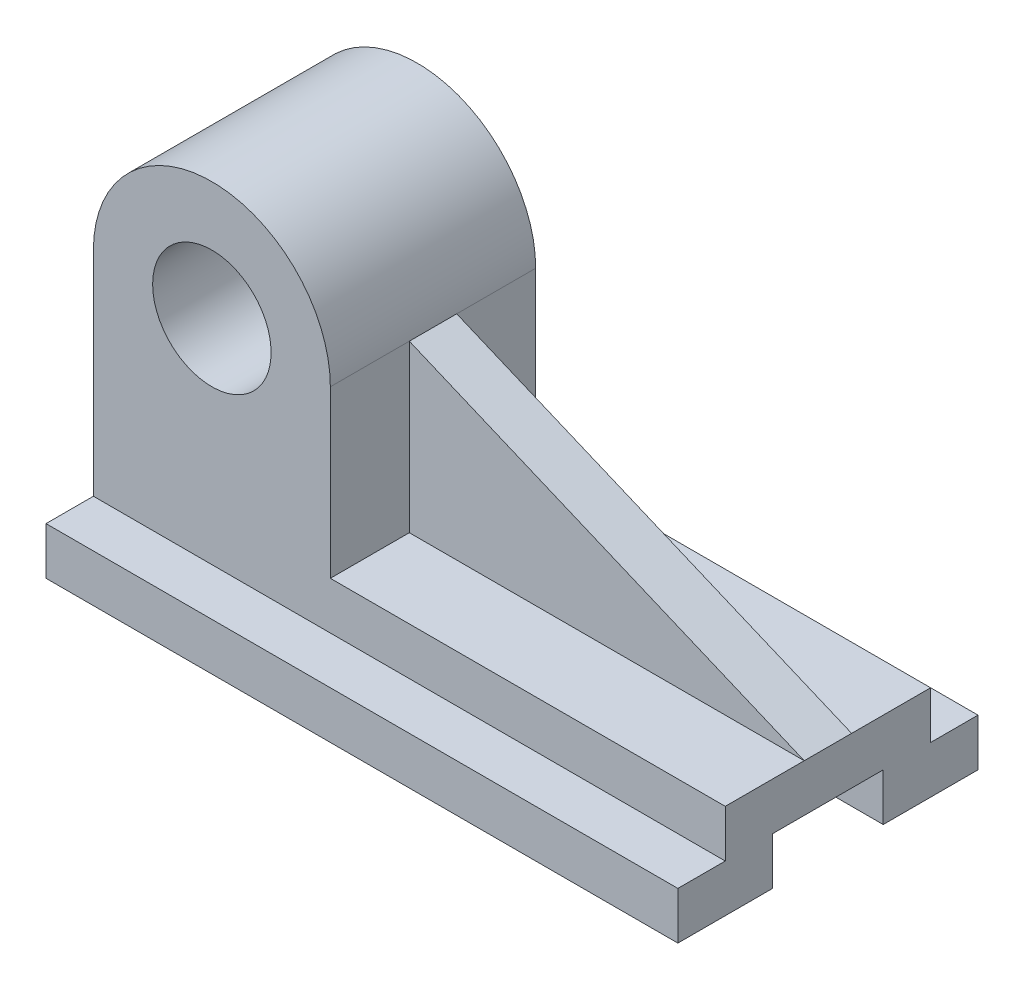
ISO-10303-21;
HEADER;
FILE_DESCRIPTION(('STEP AP214'),'2;1');
FILE_NAME('part.step','',(''),(''),'','','');
FILE_SCHEMA(('AUTOMOTIVE_DESIGN { 1 0 10303 214 1 1 1 1 }'));
ENDSEC;
DATA;
#1=APPLICATION_CONTEXT('core data for automotive mechanical design processes');
#2=APPLICATION_PROTOCOL_DEFINITION('international standard','automotive_design',2000,#1);
#3=PRODUCT_CONTEXT('',#1,'mechanical');
#4=PRODUCT('Part','Part','',(#3));
#5=PRODUCT_RELATED_PRODUCT_CATEGORY('part','',(#4));
#6=PRODUCT_DEFINITION_FORMATION('','',#4);
#7=PRODUCT_DEFINITION_CONTEXT('part definition',#1,'design');
#8=PRODUCT_DEFINITION('design','',#6,#7);
#9=PRODUCT_DEFINITION_SHAPE('','',#8);
#10=(LENGTH_UNIT() NAMED_UNIT(*) SI_UNIT(.MILLI.,.METRE.));
#11=(NAMED_UNIT(*) PLANE_ANGLE_UNIT() SI_UNIT($,.RADIAN.));
#12=(NAMED_UNIT(*) SI_UNIT($,.STERADIAN.) SOLID_ANGLE_UNIT());
#13=UNCERTAINTY_MEASURE_WITH_UNIT(LENGTH_MEASURE(1.E-05),#10,'distance_accuracy_value','');
#14=(GEOMETRIC_REPRESENTATION_CONTEXT(3) GLOBAL_UNCERTAINTY_ASSIGNED_CONTEXT((#13)) GLOBAL_UNIT_ASSIGNED_CONTEXT((#10,
#11,#12)) REPRESENTATION_CONTEXT('',''));
#15=CARTESIAN_POINT('',(0.,0.,0.));
#16=DIRECTION('',(0.,0.,1.));
#17=DIRECTION('',(1.,0.,0.));
#18=AXIS2_PLACEMENT_3D('',#15,#16,#17);
#19=CARTESIAN_POINT('',(-80.,6.,-26.));
#20=DIRECTION('',(0.,1.,0.));
#21=DIRECTION('',(0.,0.,1.));
#22=AXIS2_PLACEMENT_3D('',#19,#20,#21);
#23=PLANE('',#22);
#24=DIRECTION('',(0.,0.,-1.));
#25=VECTOR('',#24,1.);
#26=CARTESIAN_POINT('',(-20.,6.,26.));
#27=LINE('',#26,#25);
#28=CARTESIAN_POINT('',(-20.,6.,-6.));
#29=VERTEX_POINT('',#28);
#30=CARTESIAN_POINT('',(-20.,6.,-26.));
#31=VERTEX_POINT('',#30);
#32=EDGE_CURVE('E193',#29,#31,#27,.T.);
#33=ORIENTED_EDGE('',*,*,#32,.F.);
#34=DIRECTION('',(1.,0.,0.));
#35=VECTOR('',#34,1.);
#36=CARTESIAN_POINT('',(-80.,6.,-6.));
#37=LINE('',#36,#35);
#38=CARTESIAN_POINT('',(80.,6.,-6.));
#39=VERTEX_POINT('',#38);
#40=EDGE_CURVE('E183',#29,#39,#37,.T.);
#41=ORIENTED_EDGE('',*,*,#40,.T.);
#42=DIRECTION('',(0.,0.,1.));
#43=VECTOR('',#42,1.);
#44=CARTESIAN_POINT('',(80.,6.,-26.));
#45=LINE('',#44,#43);
#46=CARTESIAN_POINT('',(80.,6.,-26.));
#47=VERTEX_POINT('',#46);
#48=EDGE_CURVE('E51',#47,#39,#45,.T.);
#49=ORIENTED_EDGE('',*,*,#48,.F.);
#50=DIRECTION('',(-1.,0.,0.));
#51=VECTOR('',#50,1.);
#52=CARTESIAN_POINT('',(-80.,6.,-26.));
#53=LINE('',#52,#51);
#54=EDGE_CURVE('E215',#47,#31,#53,.T.);
#55=ORIENTED_EDGE('',*,*,#54,.T.);
#56=EDGE_LOOP('',(#33,#41,#49,#55));
#57=FACE_BOUND('',#56,.T.);
#58=ADVANCED_FACE('F47',(#57),#23,.T.);
#59=CARTESIAN_POINT('',(-20.,0.,26.));
#60=DIRECTION('',(-1.,0.,0.));
#61=DIRECTION('',(0.,0.,1.));
#62=AXIS2_PLACEMENT_3D('',#59,#60,#61);
#63=PLANE('',#62);
#64=DIRECTION('',(0.,1.,0.));
#65=VECTOR('',#64,1.);
#66=CARTESIAN_POINT('',(-20.,0.,-6.));
#67=LINE('',#66,#65);
#68=CARTESIAN_POINT('',(-20.,48.,-5.99999999999999));
#69=VERTEX_POINT('',#68);
#70=EDGE_CURVE('E185',#29,#69,#67,.T.);
#71=ORIENTED_EDGE('',*,*,#70,.F.);
#72=ORIENTED_EDGE('',*,*,#32,.T.);
#73=DIRECTION('',(0.,1.,0.));
#74=VECTOR('',#73,1.);
#75=CARTESIAN_POINT('',(-20.,0.,-26.));
#76=LINE('',#75,#74);
#77=CARTESIAN_POINT('',(-20.,48.,-26.));
#78=VERTEX_POINT('',#77);
#79=EDGE_CURVE('E333',#31,#78,#76,.T.);
#80=ORIENTED_EDGE('',*,*,#79,.T.);
#81=DIRECTION('',(0.,0.,-1.));
#82=VECTOR('',#81,1.);
#83=CARTESIAN_POINT('',(-20.,48.,26.));
#84=LINE('',#83,#82);
#85=EDGE_CURVE('E324',#69,#78,#84,.T.);
#86=ORIENTED_EDGE('',*,*,#85,.F.);
#87=EDGE_LOOP('',(#71,#72,#80,#86));
#88=FACE_BOUND('',#87,.T.);
#89=ADVANCED_FACE('F368',(#88),#63,.F.);
#90=CARTESIAN_POINT('',(-80.,-6.,-26.));
#91=DIRECTION('',(0.,-1.,0.));
#92=DIRECTION('',(0.,0.,-1.));
#93=AXIS2_PLACEMENT_3D('',#90,#91,#92);
#94=PLANE('',#93);
#95=DIRECTION('',(-1.,0.,0.));
#96=VECTOR('',#95,1.);
#97=CARTESIAN_POINT('',(-80.,-6.,14.));
#98=LINE('',#97,#96);
#99=CARTESIAN_POINT('',(80.,-6.,14.));
#100=VERTEX_POINT('',#99);
#101=CARTESIAN_POINT('',(-80.,-6.,14.));
#102=VERTEX_POINT('',#101);
#103=EDGE_CURVE('E254',#100,#102,#98,.T.);
#104=ORIENTED_EDGE('',*,*,#103,.T.);
#105=DIRECTION('',(0.,0.,1.));
#106=VECTOR('',#105,1.);
#107=CARTESIAN_POINT('',(-80.,-6.,-26.));
#108=LINE('',#107,#106);
#109=CARTESIAN_POINT('',(-80.,-6.,-14.));
#110=VERTEX_POINT('',#109);
#111=EDGE_CURVE('E57',#110,#102,#108,.T.);
#112=ORIENTED_EDGE('',*,*,#111,.F.);
#113=DIRECTION('',(1.,0.,0.));
#114=VECTOR('',#113,1.);
#115=CARTESIAN_POINT('',(80.,-6.,-14.));
#116=LINE('',#115,#114);
#117=CARTESIAN_POINT('',(80.,-6.,-14.));
#118=VERTEX_POINT('',#117);
#119=EDGE_CURVE('E295',#110,#118,#116,.T.);
#120=ORIENTED_EDGE('',*,*,#119,.T.);
#121=DIRECTION('',(0.,0.,1.));
#122=VECTOR('',#121,1.);
#123=CARTESIAN_POINT('',(80.,-6.,-26.));
#124=LINE('',#123,#122);
#125=EDGE_CURVE('E11',#118,#100,#124,.T.);
#126=ORIENTED_EDGE('',*,*,#125,.T.);
#127=EDGE_LOOP('',(#104,#112,#120,#126));
#128=FACE_BOUND('',#127,.T.);
#129=ADVANCED_FACE('F403',(#128),#94,.T.);
#130=CARTESIAN_POINT('',(80.,6.,-26.));
#131=DIRECTION('',(1.,0.,0.));
#132=DIRECTION('',(0.,0.,-1.));
#133=AXIS2_PLACEMENT_3D('',#130,#131,#132);
#134=PLANE('',#133);
#135=DIRECTION('',(0.,1.,0.));
#136=VECTOR('',#135,1.);
#137=CARTESIAN_POINT('',(80.,-6.,14.));
#138=LINE('',#137,#136);
#139=CARTESIAN_POINT('',(80.,-18.,14.));
#140=VERTEX_POINT('',#139);
#141=EDGE_CURVE('E259',#140,#100,#138,.T.);
#142=ORIENTED_EDGE('',*,*,#141,.T.);
#143=ORIENTED_EDGE('',*,*,#125,.F.);
#144=DIRECTION('',(0.,-1.,0.));
#145=VECTOR('',#144,1.);
#146=CARTESIAN_POINT('',(80.,-6.,-14.));
#147=LINE('',#146,#145);
#148=CARTESIAN_POINT('',(80.,-18.,-14.));
#149=VERTEX_POINT('',#148);
#150=EDGE_CURVE('E306',#118,#149,#147,.T.);
#151=ORIENTED_EDGE('',*,*,#150,.T.);
#152=DIRECTION('',(0.,0.,1.));
#153=VECTOR('',#152,1.);
#154=CARTESIAN_POINT('',(80.,-18.,-38.));
#155=LINE('',#154,#153);
#156=CARTESIAN_POINT('',(80.,-18.,-38.));
#157=VERTEX_POINT('',#156);
#158=EDGE_CURVE('E269',#157,#149,#155,.T.);
#159=ORIENTED_EDGE('',*,*,#158,.F.);
#160=DIRECTION('',(0.,-1.,0.));
#161=VECTOR('',#160,1.);
#162=CARTESIAN_POINT('',(80.,-6.,-38.));
#163=LINE('',#162,#161);
#164=CARTESIAN_POINT('',(80.,-6.,-38.));
#165=VERTEX_POINT('',#164);
#166=EDGE_CURVE('E298',#165,#157,#163,.T.);
#167=ORIENTED_EDGE('',*,*,#166,.F.);
#168=DIRECTION('',(0.,0.,1.));
#169=VECTOR('',#168,1.);
#170=CARTESIAN_POINT('',(80.,-6.,-38.));
#171=LINE('',#170,#169);
#172=CARTESIAN_POINT('',(80.,-6.,-26.));
#173=VERTEX_POINT('',#172);
#174=EDGE_CURVE('E291',#165,#173,#171,.T.);
#175=ORIENTED_EDGE('',*,*,#174,.T.);
#176=DIRECTION('',(0.,1.,0.));
#177=VECTOR('',#176,1.);
#178=CARTESIAN_POINT('',(80.,6.,-26.));
#179=LINE('',#178,#177);
#180=EDGE_CURVE('E199',#173,#47,#179,.T.);
#181=ORIENTED_EDGE('',*,*,#180,.T.);
#182=ORIENTED_EDGE('',*,*,#48,.T.);
#183=DIRECTION('',(0.,0.,1.));
#184=VECTOR('',#183,1.);
#185=CARTESIAN_POINT('',(80.,6.,-26.));
#186=LINE('',#185,#184);
#187=CARTESIAN_POINT('',(80.,6.,6.));
#188=VERTEX_POINT('',#187);
#189=EDGE_CURVE('E169',#188,#39,#186,.F.);
#190=ORIENTED_EDGE('',*,*,#189,.F.);
#191=CARTESIAN_POINT('',(80.,6.,26.));
#192=VERTEX_POINT('',#191);
#193=EDGE_CURVE('E201',#188,#192,#45,.T.);
#194=ORIENTED_EDGE('',*,*,#193,.T.);
#195=DIRECTION('',(0.,1.,0.));
#196=VECTOR('',#195,1.);
#197=CARTESIAN_POINT('',(80.,6.,26.));
#198=LINE('',#197,#196);
#199=CARTESIAN_POINT('',(80.,-6.,26.));
#200=VERTEX_POINT('',#199);
#201=EDGE_CURVE('E219',#200,#192,#198,.T.);
#202=ORIENTED_EDGE('',*,*,#201,.F.);
#203=DIRECTION('',(0.,0.,-1.));
#204=VECTOR('',#203,1.);
#205=CARTESIAN_POINT('',(80.,-6.,38.));
#206=LINE('',#205,#204);
#207=CARTESIAN_POINT('',(80.,-6.,38.));
#208=VERTEX_POINT('',#207);
#209=EDGE_CURVE('E246',#208,#200,#206,.T.);
#210=ORIENTED_EDGE('',*,*,#209,.F.);
#211=DIRECTION('',(0.,1.,0.));
#212=VECTOR('',#211,1.);
#213=CARTESIAN_POINT('',(80.,-6.,38.));
#214=LINE('',#213,#212);
#215=CARTESIAN_POINT('',(80.,-18.,38.));
#216=VERTEX_POINT('',#215);
#217=EDGE_CURVE('E272',#216,#208,#214,.T.);
#218=ORIENTED_EDGE('',*,*,#217,.F.);
#219=DIRECTION('',(0.,0.,-1.));
#220=VECTOR('',#219,1.);
#221=CARTESIAN_POINT('',(80.,-18.,38.));
#222=LINE('',#221,#220);
#223=EDGE_CURVE('E242',#216,#140,#222,.T.);
#224=ORIENTED_EDGE('',*,*,#223,.T.);
#225=EDGE_LOOP('',(#142,#143,#151,#159,#167,#175,#181,#182,#190,#194,#202,#210,#218,#224));
#226=FACE_BOUND('',#225,.T.);
#227=ADVANCED_FACE('F49',(#226),#134,.T.);
#228=CARTESIAN_POINT('',(-80.,6.,-26.));
#229=DIRECTION('',(-1.,0.,0.));
#230=DIRECTION('',(0.,0.,1.));
#231=AXIS2_PLACEMENT_3D('',#228,#229,#230);
#232=PLANE('',#231);
#233=DIRECTION('',(0.,0.,-1.));
#234=VECTOR('',#233,1.);
#235=CARTESIAN_POINT('',(-80.,48.,26.));
#236=LINE('',#235,#234);
#237=CARTESIAN_POINT('',(-80.,48.,26.));
#238=VERTEX_POINT('',#237);
#239=CARTESIAN_POINT('',(-80.,48.,-26.));
#240=VERTEX_POINT('',#239);
#241=EDGE_CURVE('E321',#238,#240,#236,.T.);
#242=ORIENTED_EDGE('',*,*,#241,.T.);
#243=DIRECTION('',(0.,-1.,0.));
#244=VECTOR('',#243,1.);
#245=CARTESIAN_POINT('',(-80.,6.,-26.));
#246=LINE('',#245,#244);
#247=CARTESIAN_POINT('',(-80.,-6.,-26.));
#248=VERTEX_POINT('',#247);
#249=EDGE_CURVE('E208',#240,#248,#246,.T.);
#250=ORIENTED_EDGE('',*,*,#249,.T.);
#251=DIRECTION('',(0.,0.,1.));
#252=VECTOR('',#251,1.);
#253=CARTESIAN_POINT('',(-80.,-6.,-38.));
#254=LINE('',#253,#252);
#255=CARTESIAN_POINT('',(-80.,-6.,-38.));
#256=VERTEX_POINT('',#255);
#257=EDGE_CURVE('E288',#256,#248,#254,.T.);
#258=ORIENTED_EDGE('',*,*,#257,.F.);
#259=DIRECTION('',(0.,1.,0.));
#260=VECTOR('',#259,1.);
#261=CARTESIAN_POINT('',(-80.,-6.,-38.));
#262=LINE('',#261,#260);
#263=CARTESIAN_POINT('',(-80.,-18.,-38.));
#264=VERTEX_POINT('',#263);
#265=EDGE_CURVE('E312',#264,#256,#262,.T.);
#266=ORIENTED_EDGE('',*,*,#265,.F.);
#267=DIRECTION('',(0.,0.,1.));
#268=VECTOR('',#267,1.);
#269=CARTESIAN_POINT('',(-80.,-18.,-38.));
#270=LINE('',#269,#268);
#271=CARTESIAN_POINT('',(-80.,-18.,-14.));
#272=VERTEX_POINT('',#271);
#273=EDGE_CURVE('E284',#264,#272,#270,.T.);
#274=ORIENTED_EDGE('',*,*,#273,.T.);
#275=DIRECTION('',(0.,1.,0.));
#276=VECTOR('',#275,1.);
#277=CARTESIAN_POINT('',(-80.,-6.,-14.));
#278=LINE('',#277,#276);
#279=EDGE_CURVE('E299',#272,#110,#278,.T.);
#280=ORIENTED_EDGE('',*,*,#279,.T.);
#281=ORIENTED_EDGE('',*,*,#111,.T.);
#282=DIRECTION('',(0.,-1.,0.));
#283=VECTOR('',#282,1.);
#284=CARTESIAN_POINT('',(-80.,-6.,14.));
#285=LINE('',#284,#283);
#286=CARTESIAN_POINT('',(-80.,-18.,14.));
#287=VERTEX_POINT('',#286);
#288=EDGE_CURVE('E265',#102,#287,#285,.T.);
#289=ORIENTED_EDGE('',*,*,#288,.T.);
#290=DIRECTION('',(0.,0.,-1.));
#291=VECTOR('',#290,1.);
#292=CARTESIAN_POINT('',(-80.,-18.,38.));
#293=LINE('',#292,#291);
#294=CARTESIAN_POINT('',(-80.,-18.,38.));
#295=VERTEX_POINT('',#294);
#296=EDGE_CURVE('E224',#295,#287,#293,.T.);
#297=ORIENTED_EDGE('',*,*,#296,.F.);
#298=DIRECTION('',(0.,-1.,0.));
#299=VECTOR('',#298,1.);
#300=CARTESIAN_POINT('',(-80.,-6.,38.));
#301=LINE('',#300,#299);
#302=CARTESIAN_POINT('',(-80.,-6.,38.));
#303=VERTEX_POINT('',#302);
#304=EDGE_CURVE('E258',#303,#295,#301,.T.);
#305=ORIENTED_EDGE('',*,*,#304,.F.);
#306=DIRECTION('',(0.,0.,-1.));
#307=VECTOR('',#306,1.);
#308=CARTESIAN_POINT('',(-80.,-6.,38.));
#309=LINE('',#308,#307);
#310=CARTESIAN_POINT('',(-80.,-6.,26.));
#311=VERTEX_POINT('',#310);
#312=EDGE_CURVE('E249',#303,#311,#309,.T.);
#313=ORIENTED_EDGE('',*,*,#312,.T.);
#314=DIRECTION('',(0.,-1.,0.));
#315=VECTOR('',#314,1.);
#316=CARTESIAN_POINT('',(-80.,6.,26.));
#317=LINE('',#316,#315);
#318=EDGE_CURVE('E227',#238,#311,#317,.T.);
#319=ORIENTED_EDGE('',*,*,#318,.F.);
#320=EDGE_LOOP('',(#242,#250,#258,#266,#274,#280,#281,#289,#297,#305,#313,#319));
#321=FACE_BOUND('',#320,.T.);
#322=ADVANCED_FACE('F389',(#321),#232,.T.);
#323=DIRECTION('',(1.,0.,0.));
#324=VECTOR('',#323,1.);
#325=CARTESIAN_POINT('',(-80.,6.,6.));
#326=LINE('',#325,#324);
#327=CARTESIAN_POINT('',(-20.,6.,6.));
#328=VERTEX_POINT('',#327);
#329=EDGE_CURVE('E357',#328,#188,#326,.T.);
#330=ORIENTED_EDGE('',*,*,#329,.F.);
#331=CARTESIAN_POINT('',(-20.,6.,26.));
#332=VERTEX_POINT('',#331);
#333=EDGE_CURVE('E73',#332,#328,#27,.T.);
#334=ORIENTED_EDGE('',*,*,#333,.F.);
#335=DIRECTION('',(-1.,0.,0.));
#336=VECTOR('',#335,1.);
#337=CARTESIAN_POINT('',(-80.,6.,26.));
#338=LINE('',#337,#336);
#339=EDGE_CURVE('E223',#192,#332,#338,.T.);
#340=ORIENTED_EDGE('',*,*,#339,.F.);
#341=ORIENTED_EDGE('',*,*,#193,.F.);
#342=EDGE_LOOP('',(#330,#334,#340,#341));
#343=FACE_BOUND('',#342,.T.);
#344=ADVANCED_FACE('F387',(#343),#23,.T.);
#345=CARTESIAN_POINT('',(0.,0.,-26.));
#346=DIRECTION('',(0.,0.,1.));
#347=DIRECTION('',(1.,0.,0.));
#348=AXIS2_PLACEMENT_3D('',#345,#346,#347);
#349=PLANE('',#348);
#350=ORIENTED_EDGE('',*,*,#180,.F.);
#351=DIRECTION('',(1.,0.,0.));
#352=VECTOR('',#351,1.);
#353=CARTESIAN_POINT('',(-80.,-6.,-26.));
#354=LINE('',#353,#352);
#355=EDGE_CURVE('E204',#248,#173,#354,.T.);
#356=ORIENTED_EDGE('',*,*,#355,.F.);
#357=ORIENTED_EDGE('',*,*,#249,.F.);
#358=CARTESIAN_POINT('',(-50.,48.,-26.));
#359=DIRECTION('',(0.,0.,-1.));
#360=DIRECTION('',(-1.,0.,0.));
#361=AXIS2_PLACEMENT_3D('',#358,#359,#360);
#362=CIRCLE('',#361,30.);
#363=EDGE_CURVE('E338',#240,#78,#362,.T.);
#364=ORIENTED_EDGE('',*,*,#363,.T.);
#365=ORIENTED_EDGE('',*,*,#79,.F.);
#366=ORIENTED_EDGE('',*,*,#54,.F.);
#367=EDGE_LOOP('',(#350,#356,#357,#364,#365,#366));
#368=FACE_BOUND('',#367,.T.);
#369=CARTESIAN_POINT('',(-50.,48.,-26.));
#370=DIRECTION('',(0.,0.,-1.));
#371=DIRECTION('',(-1.,0.,0.));
#372=AXIS2_PLACEMENT_3D('',#369,#370,#371);
#373=CIRCLE('',#372,15.);
#374=CARTESIAN_POINT('',(-65.,48.,-26.));
#375=VERTEX_POINT('',#374);
#376=EDGE_CURVE('E177',#375,#375,#373,.T.);
#377=ORIENTED_EDGE('',*,*,#376,.F.);
#378=EDGE_LOOP('',(#377));
#379=FACE_BOUND('',#378,.T.);
#380=ADVANCED_FACE('F371',(#368,#379),#349,.F.);
#381=CARTESIAN_POINT('',(0.,0.,26.));
#382=DIRECTION('',(0.,0.,1.));
#383=DIRECTION('',(1.,0.,0.));
#384=AXIS2_PLACEMENT_3D('',#381,#382,#383);
#385=PLANE('',#384);
#386=ORIENTED_EDGE('',*,*,#201,.T.);
#387=ORIENTED_EDGE('',*,*,#339,.T.);
#388=DIRECTION('',(0.,1.,0.));
#389=VECTOR('',#388,1.);
#390=CARTESIAN_POINT('',(-20.,0.,26.));
#391=LINE('',#390,#389);
#392=CARTESIAN_POINT('',(-20.,48.,26.));
#393=VERTEX_POINT('',#392);
#394=EDGE_CURVE('E325',#332,#393,#391,.T.);
#395=ORIENTED_EDGE('',*,*,#394,.T.);
#396=CARTESIAN_POINT('',(-50.,48.,26.));
#397=DIRECTION('',(0.,0.,-1.));
#398=DIRECTION('',(-1.,0.,0.));
#399=AXIS2_PLACEMENT_3D('',#396,#397,#398);
#400=CIRCLE('',#399,30.);
#401=EDGE_CURVE('E347',#238,#393,#400,.T.);
#402=ORIENTED_EDGE('',*,*,#401,.F.);
#403=ORIENTED_EDGE('',*,*,#318,.T.);
#404=DIRECTION('',(1.,0.,0.));
#405=VECTOR('',#404,1.);
#406=CARTESIAN_POINT('',(-80.,-6.,26.));
#407=LINE('',#406,#405);
#408=EDGE_CURVE('E231',#311,#200,#407,.T.);
#409=ORIENTED_EDGE('',*,*,#408,.T.);
#410=EDGE_LOOP('',(#386,#387,#395,#402,#403,#409));
#411=FACE_BOUND('',#410,.T.);
#412=CARTESIAN_POINT('',(-50.,48.,26.));
#413=DIRECTION('',(0.,0.,-1.));
#414=DIRECTION('',(-1.,0.,0.));
#415=AXIS2_PLACEMENT_3D('',#412,#413,#414);
#416=CIRCLE('',#415,15.);
#417=CARTESIAN_POINT('',(-65.,48.,26.));
#418=VERTEX_POINT('',#417);
#419=EDGE_CURVE('E337',#418,#418,#416,.T.);
#420=ORIENTED_EDGE('',*,*,#419,.T.);
#421=EDGE_LOOP('',(#420));
#422=FACE_BOUND('',#421,.T.);
#423=ADVANCED_FACE('F385',(#411,#422),#385,.T.);
#424=CARTESIAN_POINT('',(-80.,-18.,38.));
#425=DIRECTION('',(0.,1.,0.));
#426=DIRECTION('',(0.,0.,1.));
#427=AXIS2_PLACEMENT_3D('',#424,#425,#426);
#428=PLANE('',#427);
#429=DIRECTION('',(1.,0.,0.));
#430=VECTOR('',#429,1.);
#431=CARTESIAN_POINT('',(-80.,-18.,14.));
#432=LINE('',#431,#430);
#433=EDGE_CURVE('E262',#287,#140,#432,.T.);
#434=ORIENTED_EDGE('',*,*,#433,.T.);
#435=ORIENTED_EDGE('',*,*,#223,.F.);
#436=DIRECTION('',(1.,0.,0.));
#437=VECTOR('',#436,1.);
#438=CARTESIAN_POINT('',(-80.,-18.,38.));
#439=LINE('',#438,#437);
#440=EDGE_CURVE('E275',#295,#216,#439,.T.);
#441=ORIENTED_EDGE('',*,*,#440,.F.);
#442=ORIENTED_EDGE('',*,*,#296,.T.);
#443=EDGE_LOOP('',(#434,#435,#441,#442));
#444=FACE_BOUND('',#443,.T.);
#445=ADVANCED_FACE('F448',(#444),#428,.F.);
#446=CARTESIAN_POINT('',(-80.,-6.,38.));
#447=DIRECTION('',(0.,-1.,0.));
#448=DIRECTION('',(0.,0.,-1.));
#449=AXIS2_PLACEMENT_3D('',#446,#447,#448);
#450=PLANE('',#449);
#451=ORIENTED_EDGE('',*,*,#408,.F.);
#452=ORIENTED_EDGE('',*,*,#312,.F.);
#453=DIRECTION('',(-1.,0.,0.));
#454=VECTOR('',#453,1.);
#455=CARTESIAN_POINT('',(-80.,-6.,38.));
#456=LINE('',#455,#454);
#457=EDGE_CURVE('E253',#208,#303,#456,.T.);
#458=ORIENTED_EDGE('',*,*,#457,.F.);
#459=ORIENTED_EDGE('',*,*,#209,.T.);
#460=EDGE_LOOP('',(#451,#452,#458,#459));
#461=FACE_BOUND('',#460,.T.);
#462=ADVANCED_FACE('F441',(#461),#450,.F.);
#463=CARTESIAN_POINT('',(0.,0.,38.));
#464=DIRECTION('',(0.,0.,1.));
#465=DIRECTION('',(1.,0.,0.));
#466=AXIS2_PLACEMENT_3D('',#463,#464,#465);
#467=PLANE('',#466);
#468=ORIENTED_EDGE('',*,*,#304,.T.);
#469=ORIENTED_EDGE('',*,*,#440,.T.);
#470=ORIENTED_EDGE('',*,*,#217,.T.);
#471=ORIENTED_EDGE('',*,*,#457,.T.);
#472=EDGE_LOOP('',(#468,#469,#470,#471));
#473=FACE_BOUND('',#472,.T.);
#474=ADVANCED_FACE('F438',(#473),#467,.T.);
#475=CARTESIAN_POINT('',(0.,0.,14.));
#476=DIRECTION('',(0.,0.,1.));
#477=DIRECTION('',(1.,0.,0.));
#478=AXIS2_PLACEMENT_3D('',#475,#476,#477);
#479=PLANE('',#478);
#480=ORIENTED_EDGE('',*,*,#288,.F.);
#481=ORIENTED_EDGE('',*,*,#103,.F.);
#482=ORIENTED_EDGE('',*,*,#141,.F.);
#483=ORIENTED_EDGE('',*,*,#433,.F.);
#484=EDGE_LOOP('',(#480,#481,#482,#483));
#485=FACE_BOUND('',#484,.T.);
#486=ADVANCED_FACE('F434',(#485),#479,.F.);
#487=CARTESIAN_POINT('',(80.,-6.,-38.));
#488=DIRECTION('',(0.,-1.,0.));
#489=DIRECTION('',(0.,0.,-1.));
#490=AXIS2_PLACEMENT_3D('',#487,#488,#489);
#491=PLANE('',#490);
#492=ORIENTED_EDGE('',*,*,#257,.T.);
#493=ORIENTED_EDGE('',*,*,#355,.T.);
#494=ORIENTED_EDGE('',*,*,#174,.F.);
#495=DIRECTION('',(1.,0.,0.));
#496=VECTOR('',#495,1.);
#497=CARTESIAN_POINT('',(80.,-6.,-38.));
#498=LINE('',#497,#496);
#499=EDGE_CURVE('E294',#256,#165,#498,.T.);
#500=ORIENTED_EDGE('',*,*,#499,.F.);
#501=EDGE_LOOP('',(#492,#493,#494,#500));
#502=FACE_BOUND('',#501,.T.);
#503=ADVANCED_FACE('F431',(#502),#491,.F.);
#504=CARTESIAN_POINT('',(80.,-18.,-38.));
#505=DIRECTION('',(0.,1.,0.));
#506=DIRECTION('',(0.,0.,1.));
#507=AXIS2_PLACEMENT_3D('',#504,#505,#506);
#508=PLANE('',#507);
#509=DIRECTION('',(-1.,0.,0.));
#510=VECTOR('',#509,1.);
#511=CARTESIAN_POINT('',(80.,-18.,-14.));
#512=LINE('',#511,#510);
#513=EDGE_CURVE('E303',#149,#272,#512,.T.);
#514=ORIENTED_EDGE('',*,*,#513,.T.);
#515=ORIENTED_EDGE('',*,*,#273,.F.);
#516=DIRECTION('',(-1.,0.,0.));
#517=VECTOR('',#516,1.);
#518=CARTESIAN_POINT('',(80.,-18.,-38.));
#519=LINE('',#518,#517);
#520=EDGE_CURVE('E315',#157,#264,#519,.T.);
#521=ORIENTED_EDGE('',*,*,#520,.F.);
#522=ORIENTED_EDGE('',*,*,#158,.T.);
#523=EDGE_LOOP('',(#514,#515,#521,#522));
#524=FACE_BOUND('',#523,.T.);
#525=ADVANCED_FACE('F426',(#524),#508,.F.);
#526=CARTESIAN_POINT('',(0.,0.,-38.));
#527=DIRECTION('',(0.,0.,-1.));
#528=DIRECTION('',(-1.,0.,0.));
#529=AXIS2_PLACEMENT_3D('',#526,#527,#528);
#530=PLANE('',#529);
#531=ORIENTED_EDGE('',*,*,#166,.T.);
#532=ORIENTED_EDGE('',*,*,#520,.T.);
#533=ORIENTED_EDGE('',*,*,#265,.T.);
#534=ORIENTED_EDGE('',*,*,#499,.T.);
#535=EDGE_LOOP('',(#531,#532,#533,#534));
#536=FACE_BOUND('',#535,.T.);
#537=ADVANCED_FACE('F420',(#536),#530,.T.);
#538=CARTESIAN_POINT('',(0.,0.,-14.));
#539=DIRECTION('',(0.,0.,-1.));
#540=DIRECTION('',(-1.,0.,0.));
#541=AXIS2_PLACEMENT_3D('',#538,#539,#540);
#542=PLANE('',#541);
#543=ORIENTED_EDGE('',*,*,#150,.F.);
#544=ORIENTED_EDGE('',*,*,#119,.F.);
#545=ORIENTED_EDGE('',*,*,#279,.F.);
#546=ORIENTED_EDGE('',*,*,#513,.F.);
#547=EDGE_LOOP('',(#543,#544,#545,#546));
#548=FACE_BOUND('',#547,.T.);
#549=ADVANCED_FACE('F413',(#548),#542,.F.);
#550=ORIENTED_EDGE('',*,*,#333,.T.);
#551=DIRECTION('',(0.,1.,0.));
#552=VECTOR('',#551,1.);
#553=CARTESIAN_POINT('',(-20.,0.,6.));
#554=LINE('',#553,#552);
#555=CARTESIAN_POINT('',(-20.,48.,6.));
#556=VERTEX_POINT('',#555);
#557=EDGE_CURVE('E178',#328,#556,#554,.T.);
#558=ORIENTED_EDGE('',*,*,#557,.T.);
#559=EDGE_CURVE('E326',#393,#556,#84,.T.);
#560=ORIENTED_EDGE('',*,*,#559,.F.);
#561=ORIENTED_EDGE('',*,*,#394,.F.);
#562=EDGE_LOOP('',(#550,#558,#560,#561));
#563=FACE_BOUND('',#562,.T.);
#564=ADVANCED_FACE('F383',(#563),#63,.F.);
#565=CARTESIAN_POINT('',(-50.,48.,26.));
#566=DIRECTION('',(0.,0.,-1.));
#567=DIRECTION('',(-1.,0.,0.));
#568=AXIS2_PLACEMENT_3D('',#565,#566,#567);
#569=CYLINDRICAL_SURFACE('',#568,15.);
#570=CARTESIAN_POINT('',(-65.,48.,26.));
#571=CARTESIAN_POINT('',(-65.,48.,25.4583333333333));
#572=CARTESIAN_POINT('',(-65.,48.,24.9166666666667));
#573=CARTESIAN_POINT('',(-65.,48.,23.8333333333333));
#574=CARTESIAN_POINT('',(-65.,48.,23.2916666666667));
#575=CARTESIAN_POINT('',(-65.,48.,22.2083333333333));
#576=CARTESIAN_POINT('',(-65.,48.,21.6666666666667));
#577=CARTESIAN_POINT('',(-65.,48.,20.5833333333333));
#578=CARTESIAN_POINT('',(-65.,48.,20.0416666666667));
#579=CARTESIAN_POINT('',(-65.,48.,18.9583333333333));
#580=CARTESIAN_POINT('',(-65.,48.,18.4166666666667));
#581=CARTESIAN_POINT('',(-65.,48.,17.3333333333333));
#582=CARTESIAN_POINT('',(-65.,48.,16.7916666666667));
#583=CARTESIAN_POINT('',(-65.,48.,15.7083333333333));
#584=CARTESIAN_POINT('',(-65.,48.,15.1666666666667));
#585=CARTESIAN_POINT('',(-65.,48.,14.0833333333333));
#586=CARTESIAN_POINT('',(-65.,48.,13.5416666666667));
#587=CARTESIAN_POINT('',(-65.,48.,12.4583333333333));
#588=CARTESIAN_POINT('',(-65.,48.,11.9166666666667));
#589=CARTESIAN_POINT('',(-65.,48.,10.8333333333333));
#590=CARTESIAN_POINT('',(-65.,48.,10.2916666666667));
#591=CARTESIAN_POINT('',(-65.,48.,9.20833333333333));
#592=CARTESIAN_POINT('',(-65.,48.,8.66666666666667));
#593=CARTESIAN_POINT('',(-65.,48.,7.58333333333333));
#594=CARTESIAN_POINT('',(-65.,48.,7.04166666666667));
#595=CARTESIAN_POINT('',(-65.,48.,5.95833333333333));
#596=CARTESIAN_POINT('',(-65.,48.,5.41666666666667));
#597=CARTESIAN_POINT('',(-65.,48.,4.33333333333333));
#598=CARTESIAN_POINT('',(-65.,48.,3.79166666666667));
#599=CARTESIAN_POINT('',(-65.,48.,2.70833333333333));
#600=CARTESIAN_POINT('',(-65.,48.,2.16666666666667));
#601=CARTESIAN_POINT('',(-65.,48.,1.08333333333333));
#602=CARTESIAN_POINT('',(-65.,48.,0.541666666666667));
#603=CARTESIAN_POINT('',(-65.,48.,-0.541666666666667));
#604=CARTESIAN_POINT('',(-65.,48.,-1.08333333333333));
#605=CARTESIAN_POINT('',(-65.,48.,-2.16666666666667));
#606=CARTESIAN_POINT('',(-65.,48.,-2.70833333333333));
#607=CARTESIAN_POINT('',(-65.,48.,-3.79166666666667));
#608=CARTESIAN_POINT('',(-65.,48.,-4.33333333333333));
#609=CARTESIAN_POINT('',(-65.,48.,-5.41666666666667));
#610=CARTESIAN_POINT('',(-65.,48.,-5.95833333333333));
#611=CARTESIAN_POINT('',(-65.,48.,-7.04166666666666));
#612=CARTESIAN_POINT('',(-65.,48.,-7.58333333333333));
#613=CARTESIAN_POINT('',(-65.,48.,-8.66666666666666));
#614=CARTESIAN_POINT('',(-65.,48.,-9.20833333333333));
#615=CARTESIAN_POINT('',(-65.,48.,-10.2916666666667));
#616=CARTESIAN_POINT('',(-65.,48.,-10.8333333333333));
#617=CARTESIAN_POINT('',(-65.,48.,-11.9166666666667));
#618=CARTESIAN_POINT('',(-65.,48.,-12.4583333333333));
#619=CARTESIAN_POINT('',(-65.,48.,-13.5416666666667));
#620=CARTESIAN_POINT('',(-65.,48.,-14.0833333333333));
#621=CARTESIAN_POINT('',(-65.,48.,-15.1666666666667));
#622=CARTESIAN_POINT('',(-65.,48.,-15.7083333333333));
#623=CARTESIAN_POINT('',(-65.,48.,-16.7916666666667));
#624=CARTESIAN_POINT('',(-65.,48.,-17.3333333333333));
#625=CARTESIAN_POINT('',(-65.,48.,-18.4166666666667));
#626=CARTESIAN_POINT('',(-65.,48.,-18.9583333333333));
#627=CARTESIAN_POINT('',(-65.,48.,-20.0416666666667));
#628=CARTESIAN_POINT('',(-65.,48.,-20.5833333333333));
#629=CARTESIAN_POINT('',(-65.,48.,-21.6666666666667));
#630=CARTESIAN_POINT('',(-65.,48.,-22.2083333333333));
#631=CARTESIAN_POINT('',(-65.,48.,-23.2916666666667));
#632=CARTESIAN_POINT('',(-65.,48.,-23.8333333333333));
#633=CARTESIAN_POINT('',(-65.,48.,-24.9166666666667));
#634=CARTESIAN_POINT('',(-65.,48.,-25.4583333333333));
#635=CARTESIAN_POINT('',(-65.,48.,-26.));
#636=B_SPLINE_CURVE_WITH_KNOTS('',3,(#570,#571,#572,#573,#574,#575,#576,#577,#578,#579,#580,
#581,#582,#583,#584,#585,#586,#587,#588,#589,#590,#591,#592,#593,#594,#595,#596,#597,#598,#599,
#600,#601,#602,#603,#604,#605,#606,#607,#608,#609,#610,#611,#612,#613,#614,#615,#616,#617,#618,
#619,#620,#621,#622,#623,#624,#625,#626,#627,#628,#629,#630,#631,#632,#633,#634,#635),
.UNSPECIFIED.,.F.,.F.,(4,2,2,2,2,2,2,2,2,2,2,2,2,2,2,2,2,2,2,2,2,2,2,2,2,2,2,2,2,2,2,2,4),(0.,
1.625,3.25,4.875,6.5,8.125,9.75,11.375,13.,14.625,16.25,17.875,19.5,21.125,22.75,24.375,26.,
27.625,29.25,30.875,32.5,34.125,35.75,37.375,39.,40.625,42.25,43.875,45.5,47.125,48.75,50.375,
52.),.UNSPECIFIED.);
#637=EDGE_CURVE('BSEAM412',#418,#375,#636,.T.);
#638=ORIENTED_EDGE('',*,*,#419,.F.);
#639=ORIENTED_EDGE('',*,*,#376,.T.);
#640=ORIENTED_EDGE('',*,*,#637,.T.);
#641=ORIENTED_EDGE('',*,*,#637,.F.);
#642=EDGE_LOOP('',(#638,#640,#639,#641));
#643=FACE_BOUND('',#642,.T.);
#644=ADVANCED_FACE('F412',(#643),#569,.F.);
#645=CARTESIAN_POINT('',(-50.,48.,26.));
#646=DIRECTION('',(0.,0.,-1.));
#647=DIRECTION('',(-1.,0.,0.));
#648=AXIS2_PLACEMENT_3D('',#645,#646,#647);
#649=CYLINDRICAL_SURFACE('',#648,30.);
#650=ORIENTED_EDGE('',*,*,#363,.F.);
#651=ORIENTED_EDGE('',*,*,#241,.F.);
#652=ORIENTED_EDGE('',*,*,#401,.T.);
#653=ORIENTED_EDGE('',*,*,#559,.T.);
#654=EDGE_CURVE('E330',#556,#69,#84,.T.);
#655=ORIENTED_EDGE('',*,*,#654,.T.);
#656=ORIENTED_EDGE('',*,*,#85,.T.);
#657=EDGE_LOOP('',(#650,#651,#652,#653,#655,#656));
#658=FACE_BOUND('',#657,.T.);
#659=ADVANCED_FACE('F377',(#658),#649,.T.);
#660=CARTESIAN_POINT('',(0.,30.,6.));
#661=DIRECTION('',(0.,0.,1.));
#662=DIRECTION('',(1.,0.,0.));
#663=AXIS2_PLACEMENT_3D('',#660,#661,#662);
#664=PLANE('',#663);
#665=ORIENTED_EDGE('',*,*,#557,.F.);
#666=ORIENTED_EDGE('',*,*,#329,.T.);
#667=DIRECTION('',(0.921982105607361,-0.387232484355092,0.));
#668=VECTOR('',#667,1.);
#669=CARTESIAN_POINT('',(-20.,48.,6.));
#670=LINE('',#669,#668);
#671=EDGE_CURVE('E172',#556,#188,#670,.T.);
#672=ORIENTED_EDGE('',*,*,#671,.F.);
#673=EDGE_LOOP('',(#665,#666,#672));
#674=FACE_BOUND('',#673,.T.);
#675=ADVANCED_FACE('F381',(#674),#664,.T.);
#676=CARTESIAN_POINT('',(0.,30.,-6.));
#677=DIRECTION('',(0.,0.,1.));
#678=DIRECTION('',(1.,0.,0.));
#679=AXIS2_PLACEMENT_3D('',#676,#677,#678);
#680=PLANE('',#679);
#681=ORIENTED_EDGE('',*,*,#40,.F.);
#682=ORIENTED_EDGE('',*,*,#70,.T.);
#683=DIRECTION('',(0.921982105607361,-0.387232484355092,0.));
#684=VECTOR('',#683,1.);
#685=CARTESIAN_POINT('',(-20.,48.,-6.));
#686=LINE('',#685,#684);
#687=EDGE_CURVE('E65',#69,#39,#686,.T.);
#688=ORIENTED_EDGE('',*,*,#687,.T.);
#689=EDGE_LOOP('',(#681,#682,#688));
#690=FACE_BOUND('',#689,.T.);
#691=ADVANCED_FACE('F182',(#690),#680,.F.);
#692=CARTESIAN_POINT('',(-20.,48.,0.));
#693=DIRECTION('',(-0.387232484355092,-0.921982105607361,0.));
#694=DIRECTION('',(0.921982105607361,-0.387232484355092,0.));
#695=AXIS2_PLACEMENT_3D('',#692,#693,#694);
#696=PLANE('',#695);
#697=ORIENTED_EDGE('',*,*,#671,.T.);
#698=ORIENTED_EDGE('',*,*,#189,.T.);
#699=ORIENTED_EDGE('',*,*,#687,.F.);
#700=ORIENTED_EDGE('',*,*,#654,.F.);
#701=EDGE_LOOP('',(#697,#698,#699,#700));
#702=FACE_BOUND('',#701,.T.);
#703=ADVANCED_FACE('F170',(#702),#696,.F.);
#704=CLOSED_SHELL('',(#58,#89,#129,#227,#322,#344,#380,#423,#445,#462,#474,#486,#503,#525,#537,
#549,#564,#644,#659,#675,#691,#703));
#705=MANIFOLD_SOLID_BREP('B2',#704);
#706=ADVANCED_BREP_SHAPE_REPRESENTATION('',(#18,#705),#14);
#707=SHAPE_DEFINITION_REPRESENTATION(#9,#706);
ENDSEC;
END-ISO-10303-21;
